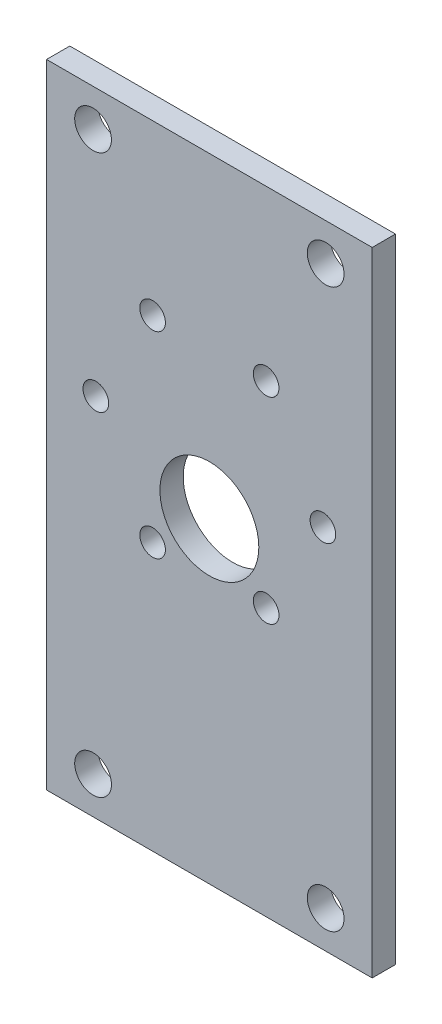
ISO-10303-21;
HEADER;
FILE_DESCRIPTION(('STEP AP214'),'2;1');
FILE_NAME('part.step','',(''),(''),'','','');
FILE_SCHEMA(('AUTOMOTIVE_DESIGN { 1 0 10303 214 1 1 1 1 }'));
ENDSEC;
DATA;
#1=APPLICATION_CONTEXT('core data for automotive mechanical design processes');
#2=APPLICATION_PROTOCOL_DEFINITION('international standard','automotive_design',2000,#1);
#3=PRODUCT_CONTEXT('',#1,'mechanical');
#4=PRODUCT('Part','Part','',(#3));
#5=PRODUCT_RELATED_PRODUCT_CATEGORY('part','',(#4));
#6=PRODUCT_DEFINITION_FORMATION('','',#4);
#7=PRODUCT_DEFINITION_CONTEXT('part definition',#1,'design');
#8=PRODUCT_DEFINITION('design','',#6,#7);
#9=PRODUCT_DEFINITION_SHAPE('','',#8);
#10=(LENGTH_UNIT() NAMED_UNIT(*) SI_UNIT(.MILLI.,.METRE.));
#11=(NAMED_UNIT(*) PLANE_ANGLE_UNIT() SI_UNIT($,.RADIAN.));
#12=(NAMED_UNIT(*) SI_UNIT($,.STERADIAN.) SOLID_ANGLE_UNIT());
#13=UNCERTAINTY_MEASURE_WITH_UNIT(LENGTH_MEASURE(1.E-05),#10,'distance_accuracy_value','');
#14=(GEOMETRIC_REPRESENTATION_CONTEXT(3) GLOBAL_UNCERTAINTY_ASSIGNED_CONTEXT((#13)) GLOBAL_UNIT_ASSIGNED_CONTEXT((#10,
#11,#12)) REPRESENTATION_CONTEXT('',''));
#15=CARTESIAN_POINT('',(0.,0.,0.));
#16=DIRECTION('',(0.,0.,1.));
#17=DIRECTION('',(1.,0.,0.));
#18=AXIS2_PLACEMENT_3D('',#15,#16,#17);
#19=CARTESIAN_POINT('',(0.,0.,3.175));
#20=DIRECTION('',(0.,0.,-1.));
#21=DIRECTION('',(-1.,0.,0.));
#22=AXIS2_PLACEMENT_3D('',#19,#20,#21);
#23=PLANE('',#22);
#24=DIRECTION('',(0.,1.,0.));
#25=VECTOR('',#24,1.);
#26=CARTESIAN_POINT('',(22.225,86.36,3.175));
#27=LINE('',#26,#25);
#28=CARTESIAN_POINT('',(22.2250000000001,0.,3.175));
#29=VERTEX_POINT('',#28);
#30=CARTESIAN_POINT('',(22.225,86.36,3.175));
#31=VERTEX_POINT('',#30);
#32=EDGE_CURVE('E52',#29,#31,#27,.T.);
#33=ORIENTED_EDGE('',*,*,#32,.T.);
#34=DIRECTION('',(-1.,0.,0.));
#35=VECTOR('',#34,1.);
#36=CARTESIAN_POINT('',(22.225,86.36,3.175));
#37=LINE('',#36,#35);
#38=CARTESIAN_POINT('',(-22.225,86.36,3.175));
#39=VERTEX_POINT('',#38);
#40=EDGE_CURVE('E82',#31,#39,#37,.T.);
#41=ORIENTED_EDGE('',*,*,#40,.T.);
#42=DIRECTION('',(0.,-1.,0.));
#43=VECTOR('',#42,1.);
#44=CARTESIAN_POINT('',(-22.225,86.36,3.175));
#45=LINE('',#44,#43);
#46=CARTESIAN_POINT('',(-22.225,0.,3.175));
#47=VERTEX_POINT('',#46);
#48=EDGE_CURVE('E86',#39,#47,#45,.T.);
#49=ORIENTED_EDGE('',*,*,#48,.T.);
#50=DIRECTION('',(1.,0.,0.));
#51=VECTOR('',#50,1.);
#52=CARTESIAN_POINT('',(22.2250000000001,0.,3.175));
#53=LINE('',#52,#51);
#54=EDGE_CURVE('E94',#47,#29,#53,.T.);
#55=ORIENTED_EDGE('',*,*,#54,.T.);
#56=EDGE_LOOP('',(#33,#41,#49,#55));
#57=FACE_BOUND('',#56,.T.);
#58=CARTESIAN_POINT('',(-15.5,49.93,3.175));
#59=DIRECTION('',(0.,0.,1.));
#60=DIRECTION('',(1.,0.,0.));
#61=AXIS2_PLACEMENT_3D('',#58,#59,#60);
#62=CIRCLE('',#61,1.74999999999998);
#63=CARTESIAN_POINT('',(-13.75,49.93,3.175));
#64=VERTEX_POINT('',#63);
#65=EDGE_CURVE('E101',#64,#64,#62,.T.);
#66=ORIENTED_EDGE('',*,*,#65,.F.);
#67=EDGE_LOOP('',(#66));
#68=FACE_BOUND('',#67,.T.);
#69=CARTESIAN_POINT('',(-7.74999999999998,63.3533937586588,3.175));
#70=DIRECTION('',(0.,0.,1.));
#71=DIRECTION('',(1.,0.,0.));
#72=AXIS2_PLACEMENT_3D('',#69,#70,#71);
#73=CIRCLE('',#72,1.74999999999996);
#74=CARTESIAN_POINT('',(-6.00000000000002,63.3533937586588,3.175));
#75=VERTEX_POINT('',#74);
#76=EDGE_CURVE('E232',#75,#75,#73,.T.);
#77=ORIENTED_EDGE('',*,*,#76,.F.);
#78=EDGE_LOOP('',(#77));
#79=FACE_BOUND('',#78,.T.);
#80=CARTESIAN_POINT('',(-7.75000000000002,36.5066062413412,3.175));
#81=DIRECTION('',(0.,0.,1.));
#82=DIRECTION('',(1.,0.,0.));
#83=AXIS2_PLACEMENT_3D('',#80,#81,#82);
#84=CIRCLE('',#83,1.75);
#85=CARTESIAN_POINT('',(-6.00000000000002,36.5066062413412,3.175));
#86=VERTEX_POINT('',#85);
#87=EDGE_CURVE('E226',#86,#86,#84,.T.);
#88=ORIENTED_EDGE('',*,*,#87,.F.);
#89=EDGE_LOOP('',(#88));
#90=FACE_BOUND('',#89,.T.);
#91=CARTESIAN_POINT('',(7.74999999999995,36.5066062413412,3.175));
#92=DIRECTION('',(0.,0.,1.));
#93=DIRECTION('',(1.,0.,0.));
#94=AXIS2_PLACEMENT_3D('',#91,#92,#93);
#95=CIRCLE('',#94,1.75000000000001);
#96=CARTESIAN_POINT('',(9.49999999999996,36.5066062413412,3.175));
#97=VERTEX_POINT('',#96);
#98=EDGE_CURVE('E220',#97,#97,#95,.T.);
#99=ORIENTED_EDGE('',*,*,#98,.F.);
#100=EDGE_LOOP('',(#99));
#101=FACE_BOUND('',#100,.T.);
#102=CARTESIAN_POINT('',(15.5,49.9299999999999,3.175));
#103=DIRECTION('',(0.,0.,1.));
#104=DIRECTION('',(1.,0.,0.));
#105=AXIS2_PLACEMENT_3D('',#102,#103,#104);
#106=CIRCLE('',#105,1.74999999999997);
#107=CARTESIAN_POINT('',(17.25,49.9299999999999,3.175));
#108=VERTEX_POINT('',#107);
#109=EDGE_CURVE('E214',#108,#108,#106,.T.);
#110=ORIENTED_EDGE('',*,*,#109,.F.);
#111=EDGE_LOOP('',(#110));
#112=FACE_BOUND('',#111,.T.);
#113=CARTESIAN_POINT('',(7.75000000000003,63.3533937586588,3.175));
#114=DIRECTION('',(0.,0.,1.));
#115=DIRECTION('',(1.,0.,0.));
#116=AXIS2_PLACEMENT_3D('',#113,#114,#115);
#117=CIRCLE('',#116,1.74999999999995);
#118=CARTESIAN_POINT('',(9.49999999999998,63.3533937586588,3.175));
#119=VERTEX_POINT('',#118);
#120=EDGE_CURVE('E208',#119,#119,#117,.T.);
#121=ORIENTED_EDGE('',*,*,#120,.F.);
#122=EDGE_LOOP('',(#121));
#123=FACE_BOUND('',#122,.T.);
#124=CARTESIAN_POINT('',(0.,43.18,3.175));
#125=DIRECTION('',(0.,0.,1.));
#126=DIRECTION('',(1.,0.,0.));
#127=AXIS2_PLACEMENT_3D('',#124,#125,#126);
#128=CIRCLE('',#127,6.75);
#129=CARTESIAN_POINT('',(6.74999999999998,43.18,3.175));
#130=VERTEX_POINT('',#129);
#131=EDGE_CURVE('E202',#130,#130,#128,.T.);
#132=ORIENTED_EDGE('',*,*,#131,.F.);
#133=EDGE_LOOP('',(#132));
#134=FACE_BOUND('',#133,.T.);
#135=CARTESIAN_POINT('',(-15.875,81.28,3.175));
#136=DIRECTION('',(0.,0.,1.));
#137=DIRECTION('',(1.,0.,0.));
#138=AXIS2_PLACEMENT_3D('',#135,#136,#137);
#139=CIRCLE('',#138,2.50825);
#140=CARTESIAN_POINT('',(-13.36675,81.28,3.175));
#141=VERTEX_POINT('',#140);
#142=EDGE_CURVE('E196',#141,#141,#139,.T.);
#143=ORIENTED_EDGE('',*,*,#142,.F.);
#144=EDGE_LOOP('',(#143));
#145=FACE_BOUND('',#144,.T.);
#146=CARTESIAN_POINT('',(15.875,81.28,3.175));
#147=DIRECTION('',(0.,0.,1.));
#148=DIRECTION('',(1.,0.,0.));
#149=AXIS2_PLACEMENT_3D('',#146,#147,#148);
#150=CIRCLE('',#149,2.50825);
#151=CARTESIAN_POINT('',(18.38325,81.28,3.175));
#152=VERTEX_POINT('',#151);
#153=EDGE_CURVE('E190',#152,#152,#150,.T.);
#154=ORIENTED_EDGE('',*,*,#153,.F.);
#155=EDGE_LOOP('',(#154));
#156=FACE_BOUND('',#155,.T.);
#157=CARTESIAN_POINT('',(15.875,5.07999999999999,3.175));
#158=DIRECTION('',(0.,0.,1.));
#159=DIRECTION('',(1.,0.,0.));
#160=AXIS2_PLACEMENT_3D('',#157,#158,#159);
#161=CIRCLE('',#160,2.50825000000001);
#162=CARTESIAN_POINT('',(18.3832500000001,5.07999999999999,3.175));
#163=VERTEX_POINT('',#162);
#164=EDGE_CURVE('E184',#163,#163,#161,.T.);
#165=ORIENTED_EDGE('',*,*,#164,.F.);
#166=EDGE_LOOP('',(#165));
#167=FACE_BOUND('',#166,.T.);
#168=CARTESIAN_POINT('',(-15.875,5.07999999999999,3.175));
#169=DIRECTION('',(0.,0.,1.));
#170=DIRECTION('',(1.,0.,0.));
#171=AXIS2_PLACEMENT_3D('',#168,#169,#170);
#172=CIRCLE('',#171,2.50825000000001);
#173=CARTESIAN_POINT('',(-13.36675,5.07999999999999,3.175));
#174=VERTEX_POINT('',#173);
#175=EDGE_CURVE('E175',#174,#174,#172,.T.);
#176=ORIENTED_EDGE('',*,*,#175,.F.);
#177=EDGE_LOOP('',(#176));
#178=FACE_BOUND('',#177,.T.);
#179=ADVANCED_FACE('F35',(#57,#68,#79,#90,#101,#112,#123,#134,#145,#156,#167,#178),#23,.F.);
#180=CARTESIAN_POINT('',(0.,0.,0.));
#181=DIRECTION('',(0.,0.,-1.));
#182=DIRECTION('',(-1.,0.,0.));
#183=AXIS2_PLACEMENT_3D('',#180,#181,#182);
#184=PLANE('',#183);
#185=CARTESIAN_POINT('',(15.875,5.07999999999999,0.));
#186=DIRECTION('',(0.,0.,1.));
#187=DIRECTION('',(1.,0.,0.));
#188=AXIS2_PLACEMENT_3D('',#185,#186,#187);
#189=CIRCLE('',#188,2.50825000000001);
#190=CARTESIAN_POINT('',(18.3832500000001,5.07999999999999,0.));
#191=VERTEX_POINT('',#190);
#192=EDGE_CURVE('E181',#191,#191,#189,.T.);
#193=ORIENTED_EDGE('',*,*,#192,.T.);
#194=EDGE_LOOP('',(#193));
#195=FACE_BOUND('',#194,.T.);
#196=CARTESIAN_POINT('',(-15.875,81.28,0.));
#197=DIRECTION('',(0.,0.,1.));
#198=DIRECTION('',(1.,0.,0.));
#199=AXIS2_PLACEMENT_3D('',#196,#197,#198);
#200=CIRCLE('',#199,2.50825);
#201=CARTESIAN_POINT('',(-13.36675,81.28,0.));
#202=VERTEX_POINT('',#201);
#203=EDGE_CURVE('E193',#202,#202,#200,.T.);
#204=ORIENTED_EDGE('',*,*,#203,.T.);
#205=EDGE_LOOP('',(#204));
#206=FACE_BOUND('',#205,.T.);
#207=CARTESIAN_POINT('',(7.75000000000003,63.3533937586588,0.));
#208=DIRECTION('',(0.,0.,1.));
#209=DIRECTION('',(1.,0.,0.));
#210=AXIS2_PLACEMENT_3D('',#207,#208,#209);
#211=CIRCLE('',#210,1.74999999999995);
#212=CARTESIAN_POINT('',(9.49999999999998,63.3533937586588,0.));
#213=VERTEX_POINT('',#212);
#214=EDGE_CURVE('E205',#213,#213,#211,.T.);
#215=ORIENTED_EDGE('',*,*,#214,.T.);
#216=EDGE_LOOP('',(#215));
#217=FACE_BOUND('',#216,.T.);
#218=CARTESIAN_POINT('',(7.74999999999995,36.5066062413412,0.));
#219=DIRECTION('',(0.,0.,1.));
#220=DIRECTION('',(1.,0.,0.));
#221=AXIS2_PLACEMENT_3D('',#218,#219,#220);
#222=CIRCLE('',#221,1.75000000000001);
#223=CARTESIAN_POINT('',(9.49999999999996,36.5066062413412,0.));
#224=VERTEX_POINT('',#223);
#225=EDGE_CURVE('E217',#224,#224,#222,.T.);
#226=ORIENTED_EDGE('',*,*,#225,.T.);
#227=EDGE_LOOP('',(#226));
#228=FACE_BOUND('',#227,.T.);
#229=CARTESIAN_POINT('',(-7.74999999999998,63.3533937586588,0.));
#230=DIRECTION('',(0.,0.,1.));
#231=DIRECTION('',(1.,0.,0.));
#232=AXIS2_PLACEMENT_3D('',#229,#230,#231);
#233=CIRCLE('',#232,1.74999999999996);
#234=CARTESIAN_POINT('',(-6.00000000000002,63.3533937586588,0.));
#235=VERTEX_POINT('',#234);
#236=EDGE_CURVE('E229',#235,#235,#233,.T.);
#237=ORIENTED_EDGE('',*,*,#236,.T.);
#238=EDGE_LOOP('',(#237));
#239=FACE_BOUND('',#238,.T.);
#240=DIRECTION('',(-1.,0.,0.));
#241=VECTOR('',#240,1.);
#242=CARTESIAN_POINT('',(22.225,86.36,0.));
#243=LINE('',#242,#241);
#244=CARTESIAN_POINT('',(22.225,86.36,0.));
#245=VERTEX_POINT('',#244);
#246=CARTESIAN_POINT('',(-22.225,86.36,0.));
#247=VERTEX_POINT('',#246);
#248=EDGE_CURVE('E90',#245,#247,#243,.T.);
#249=ORIENTED_EDGE('',*,*,#248,.F.);
#250=DIRECTION('',(0.,1.,0.));
#251=VECTOR('',#250,1.);
#252=CARTESIAN_POINT('',(22.225,35.56,0.));
#253=LINE('',#252,#251);
#254=CARTESIAN_POINT('',(22.2250000000001,0.,0.));
#255=VERTEX_POINT('',#254);
#256=EDGE_CURVE('E104',#255,#245,#253,.T.);
#257=ORIENTED_EDGE('',*,*,#256,.F.);
#258=DIRECTION('',(1.,0.,0.));
#259=VECTOR('',#258,1.);
#260=CARTESIAN_POINT('',(22.2250000000001,0.,0.));
#261=LINE('',#260,#259);
#262=CARTESIAN_POINT('',(-22.225,0.,0.));
#263=VERTEX_POINT('',#262);
#264=EDGE_CURVE('E76',#263,#255,#261,.T.);
#265=ORIENTED_EDGE('',*,*,#264,.F.);
#266=DIRECTION('',(0.,-1.,0.));
#267=VECTOR('',#266,1.);
#268=CARTESIAN_POINT('',(-22.225,35.56,0.));
#269=LINE('',#268,#267);
#270=EDGE_CURVE('E69',#247,#263,#269,.T.);
#271=ORIENTED_EDGE('',*,*,#270,.F.);
#272=EDGE_LOOP('',(#249,#257,#265,#271));
#273=FACE_BOUND('',#272,.T.);
#274=CARTESIAN_POINT('',(-15.5,49.93,0.));
#275=DIRECTION('',(0.,0.,1.));
#276=DIRECTION('',(1.,0.,0.));
#277=AXIS2_PLACEMENT_3D('',#274,#275,#276);
#278=CIRCLE('',#277,1.74999999999998);
#279=CARTESIAN_POINT('',(-13.75,49.93,0.));
#280=VERTEX_POINT('',#279);
#281=EDGE_CURVE('E235',#280,#280,#278,.T.);
#282=ORIENTED_EDGE('',*,*,#281,.T.);
#283=EDGE_LOOP('',(#282));
#284=FACE_BOUND('',#283,.T.);
#285=CARTESIAN_POINT('',(-7.75000000000002,36.5066062413412,0.));
#286=DIRECTION('',(0.,0.,1.));
#287=DIRECTION('',(1.,0.,0.));
#288=AXIS2_PLACEMENT_3D('',#285,#286,#287);
#289=CIRCLE('',#288,1.75);
#290=CARTESIAN_POINT('',(-6.00000000000002,36.5066062413412,0.));
#291=VERTEX_POINT('',#290);
#292=EDGE_CURVE('E223',#291,#291,#289,.T.);
#293=ORIENTED_EDGE('',*,*,#292,.T.);
#294=EDGE_LOOP('',(#293));
#295=FACE_BOUND('',#294,.T.);
#296=CARTESIAN_POINT('',(15.5,49.9299999999999,0.));
#297=DIRECTION('',(0.,0.,1.));
#298=DIRECTION('',(1.,0.,0.));
#299=AXIS2_PLACEMENT_3D('',#296,#297,#298);
#300=CIRCLE('',#299,1.74999999999997);
#301=CARTESIAN_POINT('',(17.25,49.9299999999999,0.));
#302=VERTEX_POINT('',#301);
#303=EDGE_CURVE('E211',#302,#302,#300,.T.);
#304=ORIENTED_EDGE('',*,*,#303,.T.);
#305=EDGE_LOOP('',(#304));
#306=FACE_BOUND('',#305,.T.);
#307=CARTESIAN_POINT('',(0.,43.18,0.));
#308=DIRECTION('',(0.,0.,1.));
#309=DIRECTION('',(1.,0.,0.));
#310=AXIS2_PLACEMENT_3D('',#307,#308,#309);
#311=CIRCLE('',#310,6.75);
#312=CARTESIAN_POINT('',(6.74999999999998,43.18,0.));
#313=VERTEX_POINT('',#312);
#314=EDGE_CURVE('E199',#313,#313,#311,.T.);
#315=ORIENTED_EDGE('',*,*,#314,.T.);
#316=EDGE_LOOP('',(#315));
#317=FACE_BOUND('',#316,.T.);
#318=CARTESIAN_POINT('',(15.875,81.28,0.));
#319=DIRECTION('',(0.,0.,1.));
#320=DIRECTION('',(1.,0.,0.));
#321=AXIS2_PLACEMENT_3D('',#318,#319,#320);
#322=CIRCLE('',#321,2.50825);
#323=CARTESIAN_POINT('',(18.38325,81.28,0.));
#324=VERTEX_POINT('',#323);
#325=EDGE_CURVE('E187',#324,#324,#322,.T.);
#326=ORIENTED_EDGE('',*,*,#325,.T.);
#327=EDGE_LOOP('',(#326));
#328=FACE_BOUND('',#327,.T.);
#329=CARTESIAN_POINT('',(-15.875,5.07999999999999,0.));
#330=DIRECTION('',(0.,0.,1.));
#331=DIRECTION('',(1.,0.,0.));
#332=AXIS2_PLACEMENT_3D('',#329,#330,#331);
#333=CIRCLE('',#332,2.50825000000001);
#334=CARTESIAN_POINT('',(-13.36675,5.07999999999999,0.));
#335=VERTEX_POINT('',#334);
#336=EDGE_CURVE('E178',#335,#335,#333,.T.);
#337=ORIENTED_EDGE('',*,*,#336,.T.);
#338=EDGE_LOOP('',(#337));
#339=FACE_BOUND('',#338,.T.);
#340=ADVANCED_FACE('F110',(#195,#206,#217,#228,#239,#273,#284,#295,#306,#317,#328,#339),#184,.T.);
#341=CARTESIAN_POINT('',(22.225,86.36,3.175));
#342=DIRECTION('',(0.,-1.,0.));
#343=DIRECTION('',(0.,0.,-1.));
#344=AXIS2_PLACEMENT_3D('',#341,#342,#343);
#345=PLANE('',#344);
#346=ORIENTED_EDGE('',*,*,#248,.T.);
#347=DIRECTION('',(0.,0.,-1.));
#348=VECTOR('',#347,1.);
#349=CARTESIAN_POINT('',(-22.225,86.36,3.175));
#350=LINE('',#349,#348);
#351=EDGE_CURVE('E44',#39,#247,#350,.T.);
#352=ORIENTED_EDGE('',*,*,#351,.F.);
#353=ORIENTED_EDGE('',*,*,#40,.F.);
#354=DIRECTION('',(0.,0.,-1.));
#355=VECTOR('',#354,1.);
#356=CARTESIAN_POINT('',(22.225,86.36,3.175));
#357=LINE('',#356,#355);
#358=EDGE_CURVE('E11',#31,#245,#357,.T.);
#359=ORIENTED_EDGE('',*,*,#358,.T.);
#360=EDGE_LOOP('',(#346,#352,#353,#359));
#361=FACE_BOUND('',#360,.T.);
#362=ADVANCED_FACE('F37',(#361),#345,.F.);
#363=CARTESIAN_POINT('',(-22.225,35.56,3.175));
#364=DIRECTION('',(1.,0.,0.));
#365=DIRECTION('',(0.,0.,-1.));
#366=AXIS2_PLACEMENT_3D('',#363,#364,#365);
#367=PLANE('',#366);
#368=ORIENTED_EDGE('',*,*,#270,.T.);
#369=DIRECTION('',(0.,0.,-1.));
#370=VECTOR('',#369,1.);
#371=CARTESIAN_POINT('',(-22.225,0.,3.175));
#372=LINE('',#371,#370);
#373=EDGE_CURVE('E91',#47,#263,#372,.T.);
#374=ORIENTED_EDGE('',*,*,#373,.F.);
#375=ORIENTED_EDGE('',*,*,#48,.F.);
#376=ORIENTED_EDGE('',*,*,#351,.T.);
#377=EDGE_LOOP('',(#368,#374,#375,#376));
#378=FACE_BOUND('',#377,.T.);
#379=ADVANCED_FACE('F92',(#378),#367,.F.);
#380=CARTESIAN_POINT('',(22.2250000000001,0.,3.175));
#381=DIRECTION('',(0.,1.,0.));
#382=DIRECTION('',(-1.,0.,0.));
#383=AXIS2_PLACEMENT_3D('',#380,#381,#382);
#384=PLANE('',#383);
#385=ORIENTED_EDGE('',*,*,#264,.T.);
#386=DIRECTION('',(0.,0.,-1.));
#387=VECTOR('',#386,1.);
#388=CARTESIAN_POINT('',(22.2250000000001,0.,3.175));
#389=LINE('',#388,#387);
#390=EDGE_CURVE('E96',#29,#255,#389,.T.);
#391=ORIENTED_EDGE('',*,*,#390,.F.);
#392=ORIENTED_EDGE('',*,*,#54,.F.);
#393=ORIENTED_EDGE('',*,*,#373,.T.);
#394=EDGE_LOOP('',(#385,#391,#392,#393));
#395=FACE_BOUND('',#394,.T.);
#396=ADVANCED_FACE('F107',(#395),#384,.F.);
#397=CARTESIAN_POINT('',(22.225,35.56,3.175));
#398=DIRECTION('',(-1.,0.,0.));
#399=DIRECTION('',(0.,-1.,0.));
#400=AXIS2_PLACEMENT_3D('',#397,#398,#399);
#401=PLANE('',#400);
#402=ORIENTED_EDGE('',*,*,#256,.T.);
#403=ORIENTED_EDGE('',*,*,#358,.F.);
#404=ORIENTED_EDGE('',*,*,#32,.F.);
#405=ORIENTED_EDGE('',*,*,#390,.T.);
#406=EDGE_LOOP('',(#402,#403,#404,#405));
#407=FACE_BOUND('',#406,.T.);
#408=ADVANCED_FACE('F112',(#407),#401,.F.);
#409=CARTESIAN_POINT('',(-15.5,49.93,3.175));
#410=DIRECTION('',(0.,0.,-1.));
#411=DIRECTION('',(-1.,0.,0.));
#412=AXIS2_PLACEMENT_3D('',#409,#410,#411);
#413=CYLINDRICAL_SURFACE('',#412,1.74999999999998);
#414=ORIENTED_EDGE('',*,*,#65,.T.);
#415=EDGE_LOOP('',(#414));
#416=FACE_BOUND('',#415,.T.);
#417=ORIENTED_EDGE('',*,*,#281,.F.);
#418=EDGE_LOOP('',(#417));
#419=FACE_BOUND('',#418,.T.);
#420=ADVANCED_FACE('F114',(#416,#419),#413,.F.);
#421=CARTESIAN_POINT('',(-7.74999999999998,63.3533937586588,3.175));
#422=DIRECTION('',(0.,0.,-1.));
#423=DIRECTION('',(-1.,0.,0.));
#424=AXIS2_PLACEMENT_3D('',#421,#422,#423);
#425=CYLINDRICAL_SURFACE('',#424,1.74999999999996);
#426=ORIENTED_EDGE('',*,*,#76,.T.);
#427=EDGE_LOOP('',(#426));
#428=FACE_BOUND('',#427,.T.);
#429=ORIENTED_EDGE('',*,*,#236,.F.);
#430=EDGE_LOOP('',(#429));
#431=FACE_BOUND('',#430,.T.);
#432=ADVANCED_FACE('F120',(#428,#431),#425,.F.);
#433=CARTESIAN_POINT('',(-7.75000000000002,36.5066062413412,3.175));
#434=DIRECTION('',(0.,0.,-1.));
#435=DIRECTION('',(-1.,0.,0.));
#436=AXIS2_PLACEMENT_3D('',#433,#434,#435);
#437=CYLINDRICAL_SURFACE('',#436,1.75);
#438=ORIENTED_EDGE('',*,*,#87,.T.);
#439=EDGE_LOOP('',(#438));
#440=FACE_BOUND('',#439,.T.);
#441=ORIENTED_EDGE('',*,*,#292,.F.);
#442=EDGE_LOOP('',(#441));
#443=FACE_BOUND('',#442,.T.);
#444=ADVANCED_FACE('F134',(#440,#443),#437,.F.);
#445=CARTESIAN_POINT('',(7.74999999999995,36.5066062413412,3.175));
#446=DIRECTION('',(0.,0.,-1.));
#447=DIRECTION('',(-1.,0.,0.));
#448=AXIS2_PLACEMENT_3D('',#445,#446,#447);
#449=CYLINDRICAL_SURFACE('',#448,1.75000000000001);
#450=ORIENTED_EDGE('',*,*,#98,.T.);
#451=EDGE_LOOP('',(#450));
#452=FACE_BOUND('',#451,.T.);
#453=ORIENTED_EDGE('',*,*,#225,.F.);
#454=EDGE_LOOP('',(#453));
#455=FACE_BOUND('',#454,.T.);
#456=ADVANCED_FACE('F138',(#452,#455),#449,.F.);
#457=CARTESIAN_POINT('',(15.5,49.9299999999999,3.175));
#458=DIRECTION('',(0.,0.,-1.));
#459=DIRECTION('',(-1.,0.,0.));
#460=AXIS2_PLACEMENT_3D('',#457,#458,#459);
#461=CYLINDRICAL_SURFACE('',#460,1.74999999999997);
#462=ORIENTED_EDGE('',*,*,#109,.T.);
#463=EDGE_LOOP('',(#462));
#464=FACE_BOUND('',#463,.T.);
#465=ORIENTED_EDGE('',*,*,#303,.F.);
#466=EDGE_LOOP('',(#465));
#467=FACE_BOUND('',#466,.T.);
#468=ADVANCED_FACE('F142',(#464,#467),#461,.F.);
#469=CARTESIAN_POINT('',(7.75000000000003,63.3533937586588,3.175));
#470=DIRECTION('',(0.,0.,-1.));
#471=DIRECTION('',(-1.,0.,0.));
#472=AXIS2_PLACEMENT_3D('',#469,#470,#471);
#473=CYLINDRICAL_SURFACE('',#472,1.74999999999995);
#474=ORIENTED_EDGE('',*,*,#120,.T.);
#475=EDGE_LOOP('',(#474));
#476=FACE_BOUND('',#475,.T.);
#477=ORIENTED_EDGE('',*,*,#214,.F.);
#478=EDGE_LOOP('',(#477));
#479=FACE_BOUND('',#478,.T.);
#480=ADVANCED_FACE('F146',(#476,#479),#473,.F.);
#481=CARTESIAN_POINT('',(0.,43.18,3.175));
#482=DIRECTION('',(0.,0.,-1.));
#483=DIRECTION('',(-1.,0.,0.));
#484=AXIS2_PLACEMENT_3D('',#481,#482,#483);
#485=CYLINDRICAL_SURFACE('',#484,6.75);
#486=ORIENTED_EDGE('',*,*,#131,.T.);
#487=EDGE_LOOP('',(#486));
#488=FACE_BOUND('',#487,.T.);
#489=ORIENTED_EDGE('',*,*,#314,.F.);
#490=EDGE_LOOP('',(#489));
#491=FACE_BOUND('',#490,.T.);
#492=ADVANCED_FACE('F150',(#488,#491),#485,.F.);
#493=CARTESIAN_POINT('',(-15.875,81.28,3.175));
#494=DIRECTION('',(0.,0.,-1.));
#495=DIRECTION('',(-1.,0.,0.));
#496=AXIS2_PLACEMENT_3D('',#493,#494,#495);
#497=CYLINDRICAL_SURFACE('',#496,2.50825);
#498=ORIENTED_EDGE('',*,*,#142,.T.);
#499=EDGE_LOOP('',(#498));
#500=FACE_BOUND('',#499,.T.);
#501=ORIENTED_EDGE('',*,*,#203,.F.);
#502=EDGE_LOOP('',(#501));
#503=FACE_BOUND('',#502,.T.);
#504=ADVANCED_FACE('F154',(#500,#503),#497,.F.);
#505=CARTESIAN_POINT('',(15.875,81.28,3.175));
#506=DIRECTION('',(0.,0.,-1.));
#507=DIRECTION('',(-1.,0.,0.));
#508=AXIS2_PLACEMENT_3D('',#505,#506,#507);
#509=CYLINDRICAL_SURFACE('',#508,2.50825);
#510=ORIENTED_EDGE('',*,*,#153,.T.);
#511=EDGE_LOOP('',(#510));
#512=FACE_BOUND('',#511,.T.);
#513=ORIENTED_EDGE('',*,*,#325,.F.);
#514=EDGE_LOOP('',(#513));
#515=FACE_BOUND('',#514,.T.);
#516=ADVANCED_FACE('F158',(#512,#515),#509,.F.);
#517=CARTESIAN_POINT('',(15.875,5.07999999999999,3.175));
#518=DIRECTION('',(0.,0.,-1.));
#519=DIRECTION('',(-1.,0.,0.));
#520=AXIS2_PLACEMENT_3D('',#517,#518,#519);
#521=CYLINDRICAL_SURFACE('',#520,2.50825000000001);
#522=ORIENTED_EDGE('',*,*,#164,.T.);
#523=EDGE_LOOP('',(#522));
#524=FACE_BOUND('',#523,.T.);
#525=ORIENTED_EDGE('',*,*,#192,.F.);
#526=EDGE_LOOP('',(#525));
#527=FACE_BOUND('',#526,.T.);
#528=ADVANCED_FACE('F162',(#524,#527),#521,.F.);
#529=CARTESIAN_POINT('',(-15.875,5.07999999999999,3.175));
#530=DIRECTION('',(0.,0.,-1.));
#531=DIRECTION('',(-1.,0.,0.));
#532=AXIS2_PLACEMENT_3D('',#529,#530,#531);
#533=CYLINDRICAL_SURFACE('',#532,2.50825000000001);
#534=ORIENTED_EDGE('',*,*,#175,.T.);
#535=EDGE_LOOP('',(#534));
#536=FACE_BOUND('',#535,.T.);
#537=ORIENTED_EDGE('',*,*,#336,.F.);
#538=EDGE_LOOP('',(#537));
#539=FACE_BOUND('',#538,.T.);
#540=ADVANCED_FACE('F166',(#536,#539),#533,.F.);
#541=CLOSED_SHELL('',(#179,#340,#362,#379,#396,#408,#420,#432,#444,#456,#468,#480,#492,#504,
#516,#528,#540));
#542=MANIFOLD_SOLID_BREP('B2',#541);
#543=ADVANCED_BREP_SHAPE_REPRESENTATION('',(#18,#542),#14);
#544=SHAPE_DEFINITION_REPRESENTATION(#9,#543);
ENDSEC;
END-ISO-10303-21;
